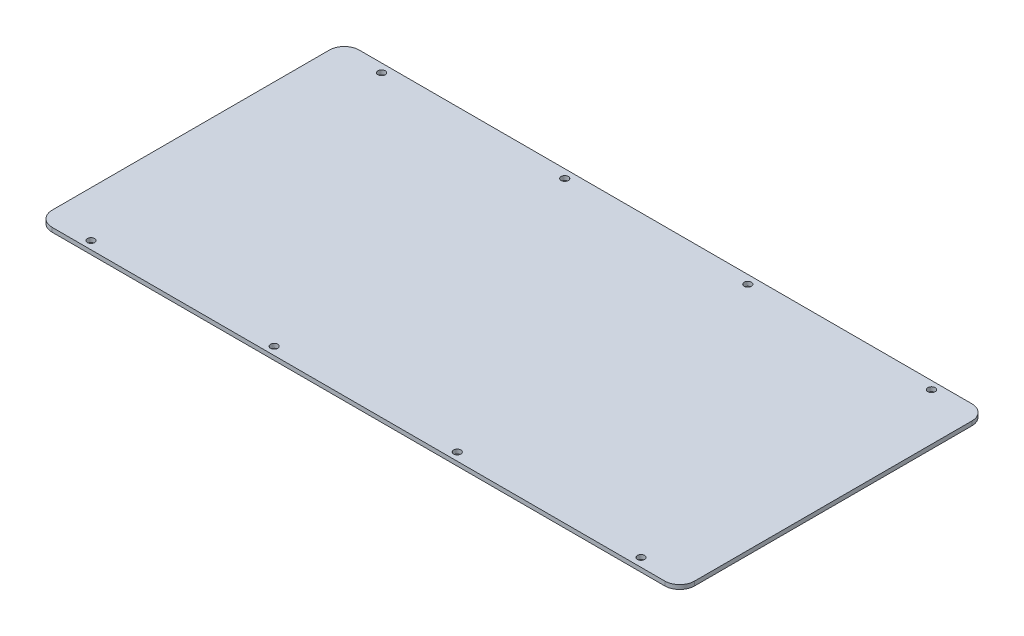
ISO-10303-21;
HEADER;
FILE_DESCRIPTION(('STEP AP214'),'2;1');
FILE_NAME('part.step','',(''),(''),'','','');
FILE_SCHEMA(('AUTOMOTIVE_DESIGN { 1 0 10303 214 1 1 1 1 }'));
ENDSEC;
DATA;
#1=APPLICATION_CONTEXT('core data for automotive mechanical design processes');
#2=APPLICATION_PROTOCOL_DEFINITION('international standard','automotive_design',2000,#1);
#3=PRODUCT_CONTEXT('',#1,'mechanical');
#4=PRODUCT('Part','Part','',(#3));
#5=PRODUCT_RELATED_PRODUCT_CATEGORY('part','',(#4));
#6=PRODUCT_DEFINITION_FORMATION('','',#4);
#7=PRODUCT_DEFINITION_CONTEXT('part definition',#1,'design');
#8=PRODUCT_DEFINITION('design','',#6,#7);
#9=PRODUCT_DEFINITION_SHAPE('','',#8);
#10=(LENGTH_UNIT() NAMED_UNIT(*) SI_UNIT(.MILLI.,.METRE.));
#11=(NAMED_UNIT(*) PLANE_ANGLE_UNIT() SI_UNIT($,.RADIAN.));
#12=(NAMED_UNIT(*) SI_UNIT($,.STERADIAN.) SOLID_ANGLE_UNIT());
#13=UNCERTAINTY_MEASURE_WITH_UNIT(LENGTH_MEASURE(1.E-05),#10,'distance_accuracy_value','');
#14=(GEOMETRIC_REPRESENTATION_CONTEXT(3) GLOBAL_UNCERTAINTY_ASSIGNED_CONTEXT((#13)) GLOBAL_UNIT_ASSIGNED_CONTEXT((#10,
#11,#12)) REPRESENTATION_CONTEXT('',''));
#15=CARTESIAN_POINT('',(0.,0.,0.));
#16=DIRECTION('',(0.,0.,1.));
#17=DIRECTION('',(1.,0.,0.));
#18=AXIS2_PLACEMENT_3D('',#15,#16,#17);
#19=CARTESIAN_POINT('',(0.,0.,0.));
#20=DIRECTION('',(0.,-1.,0.));
#21=DIRECTION('',(0.,0.,-1.));
#22=AXIS2_PLACEMENT_3D('',#19,#20,#21);
#23=PLANE('',#22);
#24=CARTESIAN_POINT('',(305.993493561658,0.,-207.19586570233));
#25=DIRECTION('',(0.,1.,0.));
#26=DIRECTION('',(0.,0.,1.));
#27=AXIS2_PLACEMENT_3D('',#24,#25,#26);
#28=CIRCLE('',#27,1.69999999999992);
#29=CARTESIAN_POINT('',(305.993493561658,0.,-205.49586570233));
#30=VERTEX_POINT('',#29);
#31=EDGE_CURVE('E197',#30,#30,#28,.T.);
#32=ORIENTED_EDGE('',*,*,#31,.T.);
#33=EDGE_LOOP('',(#32));
#34=FACE_BOUND('',#33,.T.);
#35=CARTESIAN_POINT('',(133.993493561658,0.,-70.4964057023296));
#36=DIRECTION('',(0.,1.,0.));
#37=DIRECTION('',(0.,0.,1.));
#38=AXIS2_PLACEMENT_3D('',#35,#36,#37);
#39=CIRCLE('',#38,1.70000000000001);
#40=CARTESIAN_POINT('',(133.993493561658,0.,-68.7964057023296));
#41=VERTEX_POINT('',#40);
#42=EDGE_CURVE('E190',#41,#41,#39,.T.);
#43=ORIENTED_EDGE('',*,*,#42,.T.);
#44=EDGE_LOOP('',(#43));
#45=FACE_BOUND('',#44,.T.);
#46=CARTESIAN_POINT('',(47.9934935616575,0.,-70.4964057023296));
#47=DIRECTION('',(0.,1.,0.));
#48=DIRECTION('',(0.,0.,1.));
#49=AXIS2_PLACEMENT_3D('',#46,#47,#48);
#50=CIRCLE('',#49,1.7);
#51=CARTESIAN_POINT('',(47.9934935616575,0.,-68.7964057023296));
#52=VERTEX_POINT('',#51);
#53=EDGE_CURVE('E208',#52,#52,#50,.T.);
#54=ORIENTED_EDGE('',*,*,#53,.T.);
#55=EDGE_LOOP('',(#54));
#56=FACE_BOUND('',#55,.T.);
#57=CARTESIAN_POINT('',(219.993493561658,0.,-70.4964057023296));
#58=DIRECTION('',(0.,1.,0.));
#59=DIRECTION('',(0.,0.,1.));
#60=AXIS2_PLACEMENT_3D('',#57,#58,#59);
#61=CIRCLE('',#60,1.70000000000001);
#62=CARTESIAN_POINT('',(219.993493561658,0.,-68.7964057023296));
#63=VERTEX_POINT('',#62);
#64=EDGE_CURVE('E202',#63,#63,#61,.T.);
#65=ORIENTED_EDGE('',*,*,#64,.T.);
#66=EDGE_LOOP('',(#65));
#67=FACE_BOUND('',#66,.T.);
#68=CARTESIAN_POINT('',(133.993493561658,0.,-206.94586570233));
#69=DIRECTION('',(0.,1.,0.));
#70=DIRECTION('',(0.,0.,1.));
#71=AXIS2_PLACEMENT_3D('',#68,#69,#70);
#72=CIRCLE('',#71,1.70000000000001);
#73=CARTESIAN_POINT('',(133.993493561658,0.,-205.24586570233));
#74=VERTEX_POINT('',#73);
#75=EDGE_CURVE('E172',#74,#74,#72,.T.);
#76=ORIENTED_EDGE('',*,*,#75,.T.);
#77=EDGE_LOOP('',(#76));
#78=FACE_BOUND('',#77,.T.);
#79=CARTESIAN_POINT('',(305.993493561658,0.,-70.7464057023296));
#80=DIRECTION('',(0.,1.,0.));
#81=DIRECTION('',(0.,0.,1.));
#82=AXIS2_PLACEMENT_3D('',#79,#80,#81);
#83=CIRCLE('',#82,1.69999999999992);
#84=CARTESIAN_POINT('',(305.993493561658,0.,-69.0464057023297));
#85=VERTEX_POINT('',#84);
#86=EDGE_CURVE('E12',#85,#85,#83,.T.);
#87=ORIENTED_EDGE('',*,*,#86,.T.);
#88=EDGE_LOOP('',(#87));
#89=FACE_BOUND('',#88,.T.);
#90=CARTESIAN_POINT('',(219.993493561658,0.,-206.94586570233));
#91=DIRECTION('',(0.,1.,0.));
#92=DIRECTION('',(0.,0.,1.));
#93=AXIS2_PLACEMENT_3D('',#90,#91,#92);
#94=CIRCLE('',#93,1.70000000000001);
#95=CARTESIAN_POINT('',(219.993493561658,0.,-205.24586570233));
#96=VERTEX_POINT('',#95);
#97=EDGE_CURVE('E178',#96,#96,#94,.T.);
#98=ORIENTED_EDGE('',*,*,#97,.T.);
#99=EDGE_LOOP('',(#98));
#100=FACE_BOUND('',#99,.T.);
#101=CARTESIAN_POINT('',(47.9934935616575,0.,-206.94586570233));
#102=DIRECTION('',(0.,1.,0.));
#103=DIRECTION('',(0.,0.,1.));
#104=AXIS2_PLACEMENT_3D('',#101,#102,#103);
#105=CIRCLE('',#104,1.7);
#106=CARTESIAN_POINT('',(47.9934935616575,0.,-205.24586570233));
#107=VERTEX_POINT('',#106);
#108=EDGE_CURVE('E185',#107,#107,#105,.T.);
#109=ORIENTED_EDGE('',*,*,#108,.T.);
#110=EDGE_LOOP('',(#109));
#111=FACE_BOUND('',#110,.T.);
#112=DIRECTION('',(0.,0.,1.));
#113=VECTOR('',#112,1.);
#114=CARTESIAN_POINT('',(26.4934935616575,0.,-73.7464057023296));
#115=LINE('',#114,#113);
#116=CARTESIAN_POINT('',(26.4934935616575,0.,-203.94586570233));
#117=VERTEX_POINT('',#116);
#118=CARTESIAN_POINT('',(26.4934935616575,0.,-73.7464057023296));
#119=VERTEX_POINT('',#118);
#120=EDGE_CURVE('E121',#117,#119,#115,.T.);
#121=ORIENTED_EDGE('',*,*,#120,.F.);
#122=CARTESIAN_POINT('',(33.4934935616575,0.,-203.94586570233));
#123=DIRECTION('',(0.,1.,0.));
#124=DIRECTION('',(0.,0.,1.));
#125=AXIS2_PLACEMENT_3D('',#122,#123,#124);
#126=CIRCLE('',#125,7.);
#127=CARTESIAN_POINT('',(33.4934935616575,0.,-210.94586570233));
#128=VERTEX_POINT('',#127);
#129=EDGE_CURVE('E62',#128,#117,#126,.T.);
#130=ORIENTED_EDGE('',*,*,#129,.F.);
#131=DIRECTION('',(-1.,0.,0.));
#132=VECTOR('',#131,1.);
#133=CARTESIAN_POINT('',(33.4934935616575,0.,-210.94586570233));
#134=LINE('',#133,#132);
#135=CARTESIAN_POINT('',(321.192843561658,0.,-210.94586570233));
#136=VERTEX_POINT('',#135);
#137=EDGE_CURVE('E136',#136,#128,#134,.T.);
#138=ORIENTED_EDGE('',*,*,#137,.F.);
#139=CARTESIAN_POINT('',(321.192843561658,0.,-203.94586570233));
#140=DIRECTION('',(0.,1.,0.));
#141=DIRECTION('',(0.,0.,1.));
#142=AXIS2_PLACEMENT_3D('',#139,#140,#141);
#143=CIRCLE('',#142,7.00000000000001);
#144=CARTESIAN_POINT('',(328.192843561658,0.,-203.94586570233));
#145=VERTEX_POINT('',#144);
#146=EDGE_CURVE('E133',#145,#136,#143,.T.);
#147=ORIENTED_EDGE('',*,*,#146,.F.);
#148=DIRECTION('',(0.,0.,-1.));
#149=VECTOR('',#148,1.);
#150=CARTESIAN_POINT('',(328.192843561658,0.,-203.94586570233));
#151=LINE('',#150,#149);
#152=CARTESIAN_POINT('',(328.192843561658,0.,-73.7464057023296));
#153=VERTEX_POINT('',#152);
#154=EDGE_CURVE('E127',#153,#145,#151,.T.);
#155=ORIENTED_EDGE('',*,*,#154,.F.);
#156=CARTESIAN_POINT('',(321.192843561658,0.,-73.7464057023296));
#157=DIRECTION('',(0.,1.,0.));
#158=DIRECTION('',(0.,0.,1.));
#159=AXIS2_PLACEMENT_3D('',#156,#157,#158);
#160=CIRCLE('',#159,7.);
#161=CARTESIAN_POINT('',(321.192843561658,0.,-66.7464057023296));
#162=VERTEX_POINT('',#161);
#163=EDGE_CURVE('E125',#162,#153,#160,.T.);
#164=ORIENTED_EDGE('',*,*,#163,.F.);
#165=DIRECTION('',(1.,0.,0.));
#166=VECTOR('',#165,1.);
#167=CARTESIAN_POINT('',(321.192843561658,0.,-66.7464057023296));
#168=LINE('',#167,#166);
#169=CARTESIAN_POINT('',(33.4934935616576,0.,-66.7464057023296));
#170=VERTEX_POINT('',#169);
#171=EDGE_CURVE('E108',#170,#162,#168,.T.);
#172=ORIENTED_EDGE('',*,*,#171,.F.);
#173=CARTESIAN_POINT('',(33.4934935616575,0.,-73.7464057023296));
#174=DIRECTION('',(0.,1.,0.));
#175=DIRECTION('',(0.,0.,1.));
#176=AXIS2_PLACEMENT_3D('',#173,#174,#175);
#177=CIRCLE('',#176,7.);
#178=EDGE_CURVE('E116',#119,#170,#177,.T.);
#179=ORIENTED_EDGE('',*,*,#178,.F.);
#180=EDGE_LOOP('',(#121,#130,#138,#147,#155,#164,#172,#179));
#181=FACE_BOUND('',#180,.T.);
#182=ADVANCED_FACE('F40',(#34,#45,#56,#67,#78,#89,#100,#111,#181),#23,.T.);
#183=CARTESIAN_POINT('',(305.993493561658,0.,-70.7464057023296));
#184=DIRECTION('',(0.,1.,0.));
#185=DIRECTION('',(0.,0.,1.));
#186=AXIS2_PLACEMENT_3D('',#183,#184,#185);
#187=CYLINDRICAL_SURFACE('',#186,1.69999999999992);
#188=ORIENTED_EDGE('',*,*,#86,.F.);
#189=EDGE_LOOP('',(#188));
#190=FACE_BOUND('',#189,.T.);
#191=CARTESIAN_POINT('',(305.993493561658,2.,-70.7464057023296));
#192=DIRECTION('',(0.,1.,0.));
#193=DIRECTION('',(0.,0.,1.));
#194=AXIS2_PLACEMENT_3D('',#191,#192,#193);
#195=CIRCLE('',#194,1.69999999999992);
#196=CARTESIAN_POINT('',(305.993493561658,2.,-69.0464057023297));
#197=VERTEX_POINT('',#196);
#198=EDGE_CURVE('E43',#197,#197,#195,.T.);
#199=ORIENTED_EDGE('',*,*,#198,.T.);
#200=EDGE_LOOP('',(#199));
#201=FACE_BOUND('',#200,.T.);
#202=ADVANCED_FACE('F261',(#190,#201),#187,.F.);
#203=CARTESIAN_POINT('',(219.993493561658,0.,-206.94586570233));
#204=DIRECTION('',(0.,1.,0.));
#205=DIRECTION('',(0.,0.,1.));
#206=AXIS2_PLACEMENT_3D('',#203,#204,#205);
#207=CYLINDRICAL_SURFACE('',#206,1.70000000000001);
#208=ORIENTED_EDGE('',*,*,#97,.F.);
#209=EDGE_LOOP('',(#208));
#210=FACE_BOUND('',#209,.T.);
#211=CARTESIAN_POINT('',(219.993493561658,2.,-206.94586570233));
#212=DIRECTION('',(0.,1.,0.));
#213=DIRECTION('',(0.,0.,1.));
#214=AXIS2_PLACEMENT_3D('',#211,#212,#213);
#215=CIRCLE('',#214,1.70000000000001);
#216=CARTESIAN_POINT('',(219.993493561658,2.,-205.24586570233));
#217=VERTEX_POINT('',#216);
#218=EDGE_CURVE('E182',#217,#217,#215,.T.);
#219=ORIENTED_EDGE('',*,*,#218,.T.);
#220=EDGE_LOOP('',(#219));
#221=FACE_BOUND('',#220,.T.);
#222=ADVANCED_FACE('F266',(#210,#221),#207,.F.);
#223=CARTESIAN_POINT('',(47.9934935616575,0.,-206.94586570233));
#224=DIRECTION('',(0.,1.,0.));
#225=DIRECTION('',(0.,0.,1.));
#226=AXIS2_PLACEMENT_3D('',#223,#224,#225);
#227=CYLINDRICAL_SURFACE('',#226,1.7);
#228=ORIENTED_EDGE('',*,*,#108,.F.);
#229=EDGE_LOOP('',(#228));
#230=FACE_BOUND('',#229,.T.);
#231=CARTESIAN_POINT('',(47.9934935616575,2.,-206.94586570233));
#232=DIRECTION('',(0.,1.,0.));
#233=DIRECTION('',(0.,0.,1.));
#234=AXIS2_PLACEMENT_3D('',#231,#232,#233);
#235=CIRCLE('',#234,1.7);
#236=CARTESIAN_POINT('',(47.9934935616575,2.,-205.24586570233));
#237=VERTEX_POINT('',#236);
#238=EDGE_CURVE('E175',#237,#237,#235,.T.);
#239=ORIENTED_EDGE('',*,*,#238,.T.);
#240=EDGE_LOOP('',(#239));
#241=FACE_BOUND('',#240,.T.);
#242=ADVANCED_FACE('F285',(#230,#241),#227,.F.);
#243=CARTESIAN_POINT('',(33.4934935616575,0.,-203.94586570233));
#244=DIRECTION('',(0.,1.,0.));
#245=DIRECTION('',(0.,0.,1.));
#246=AXIS2_PLACEMENT_3D('',#243,#244,#245);
#247=CYLINDRICAL_SURFACE('',#246,7.);
#248=CARTESIAN_POINT('',(33.4934935616575,2.,-203.94586570233));
#249=DIRECTION('',(0.,1.,0.));
#250=DIRECTION('',(0.,0.,1.));
#251=AXIS2_PLACEMENT_3D('',#248,#249,#250);
#252=CIRCLE('',#251,7.);
#253=CARTESIAN_POINT('',(33.4934935616575,2.,-210.94586570233));
#254=VERTEX_POINT('',#253);
#255=CARTESIAN_POINT('',(26.4934935616575,2.,-203.94586570233));
#256=VERTEX_POINT('',#255);
#257=EDGE_CURVE('E140',#254,#256,#252,.T.);
#258=ORIENTED_EDGE('',*,*,#257,.F.);
#259=DIRECTION('',(0.,1.,0.));
#260=VECTOR('',#259,1.);
#261=CARTESIAN_POINT('',(33.4934935616575,0.,-210.94586570233));
#262=LINE('',#261,#260);
#263=EDGE_CURVE('E160',#128,#254,#262,.T.);
#264=ORIENTED_EDGE('',*,*,#263,.F.);
#265=ORIENTED_EDGE('',*,*,#129,.T.);
#266=DIRECTION('',(0.,1.,0.));
#267=VECTOR('',#266,1.);
#268=CARTESIAN_POINT('',(26.4934935616575,0.,-203.94586570233));
#269=LINE('',#268,#267);
#270=EDGE_CURVE('E139',#117,#256,#269,.T.);
#271=ORIENTED_EDGE('',*,*,#270,.T.);
#272=EDGE_LOOP('',(#258,#264,#265,#271));
#273=FACE_BOUND('',#272,.T.);
#274=ADVANCED_FACE('F235',(#273),#247,.T.);
#275=CARTESIAN_POINT('',(33.4934935616575,0.,-210.94586570233));
#276=DIRECTION('',(0.,0.,-1.));
#277=DIRECTION('',(-1.,0.,0.));
#278=AXIS2_PLACEMENT_3D('',#275,#276,#277);
#279=PLANE('',#278);
#280=DIRECTION('',(-1.,0.,0.));
#281=VECTOR('',#280,1.);
#282=CARTESIAN_POINT('',(33.4934935616575,2.,-210.94586570233));
#283=LINE('',#282,#281);
#284=CARTESIAN_POINT('',(321.192843561658,2.,-210.94586570233));
#285=VERTEX_POINT('',#284);
#286=EDGE_CURVE('E157',#285,#254,#283,.T.);
#287=ORIENTED_EDGE('',*,*,#286,.F.);
#288=DIRECTION('',(0.,1.,0.));
#289=VECTOR('',#288,1.);
#290=CARTESIAN_POINT('',(321.192843561658,0.,-210.94586570233));
#291=LINE('',#290,#289);
#292=EDGE_CURVE('E163',#136,#285,#291,.T.);
#293=ORIENTED_EDGE('',*,*,#292,.F.);
#294=ORIENTED_EDGE('',*,*,#137,.T.);
#295=ORIENTED_EDGE('',*,*,#263,.T.);
#296=EDGE_LOOP('',(#287,#293,#294,#295));
#297=FACE_BOUND('',#296,.T.);
#298=ADVANCED_FACE('F242',(#297),#279,.T.);
#299=CARTESIAN_POINT('',(321.192843561658,0.,-203.94586570233));
#300=DIRECTION('',(0.,1.,0.));
#301=DIRECTION('',(0.,0.,1.));
#302=AXIS2_PLACEMENT_3D('',#299,#300,#301);
#303=CYLINDRICAL_SURFACE('',#302,7.00000000000001);
#304=CARTESIAN_POINT('',(321.192843561658,2.,-203.94586570233));
#305=DIRECTION('',(0.,1.,0.));
#306=DIRECTION('',(0.,0.,1.));
#307=AXIS2_PLACEMENT_3D('',#304,#305,#306);
#308=CIRCLE('',#307,7.00000000000001);
#309=CARTESIAN_POINT('',(328.192843561658,2.,-203.94586570233));
#310=VERTEX_POINT('',#309);
#311=EDGE_CURVE('E154',#310,#285,#308,.T.);
#312=ORIENTED_EDGE('',*,*,#311,.F.);
#313=DIRECTION('',(0.,1.,0.));
#314=VECTOR('',#313,1.);
#315=CARTESIAN_POINT('',(328.192843561658,0.,-203.94586570233));
#316=LINE('',#315,#314);
#317=EDGE_CURVE('E165',#145,#310,#316,.T.);
#318=ORIENTED_EDGE('',*,*,#317,.F.);
#319=ORIENTED_EDGE('',*,*,#146,.T.);
#320=ORIENTED_EDGE('',*,*,#292,.T.);
#321=EDGE_LOOP('',(#312,#318,#319,#320));
#322=FACE_BOUND('',#321,.T.);
#323=ADVANCED_FACE('F245',(#322),#303,.T.);
#324=CARTESIAN_POINT('',(328.192843561658,0.,-203.94586570233));
#325=DIRECTION('',(1.,0.,0.));
#326=DIRECTION('',(0.,0.,-1.));
#327=AXIS2_PLACEMENT_3D('',#324,#325,#326);
#328=PLANE('',#327);
#329=DIRECTION('',(0.,0.,-1.));
#330=VECTOR('',#329,1.);
#331=CARTESIAN_POINT('',(328.192843561658,2.,-203.94586570233));
#332=LINE('',#331,#330);
#333=CARTESIAN_POINT('',(328.192843561658,2.,-73.7464057023296));
#334=VERTEX_POINT('',#333);
#335=EDGE_CURVE('E151',#334,#310,#332,.T.);
#336=ORIENTED_EDGE('',*,*,#335,.F.);
#337=DIRECTION('',(0.,1.,0.));
#338=VECTOR('',#337,1.);
#339=CARTESIAN_POINT('',(328.192843561658,0.,-73.7464057023296));
#340=LINE('',#339,#338);
#341=EDGE_CURVE('E167',#153,#334,#340,.T.);
#342=ORIENTED_EDGE('',*,*,#341,.F.);
#343=ORIENTED_EDGE('',*,*,#154,.T.);
#344=ORIENTED_EDGE('',*,*,#317,.T.);
#345=EDGE_LOOP('',(#336,#342,#343,#344));
#346=FACE_BOUND('',#345,.T.);
#347=ADVANCED_FACE('F248',(#346),#328,.T.);
#348=CARTESIAN_POINT('',(321.192843561658,0.,-73.7464057023296));
#349=DIRECTION('',(0.,1.,0.));
#350=DIRECTION('',(0.,0.,1.));
#351=AXIS2_PLACEMENT_3D('',#348,#349,#350);
#352=CYLINDRICAL_SURFACE('',#351,7.);
#353=CARTESIAN_POINT('',(321.192843561658,2.,-73.7464057023296));
#354=DIRECTION('',(0.,1.,0.));
#355=DIRECTION('',(0.,0.,1.));
#356=AXIS2_PLACEMENT_3D('',#353,#354,#355);
#357=CIRCLE('',#356,7.);
#358=CARTESIAN_POINT('',(321.192843561658,2.,-66.7464057023296));
#359=VERTEX_POINT('',#358);
#360=EDGE_CURVE('E148',#359,#334,#357,.T.);
#361=ORIENTED_EDGE('',*,*,#360,.F.);
#362=DIRECTION('',(0.,1.,0.));
#363=VECTOR('',#362,1.);
#364=CARTESIAN_POINT('',(321.192843561658,0.,-66.7464057023296));
#365=LINE('',#364,#363);
#366=EDGE_CURVE('E112',#162,#359,#365,.T.);
#367=ORIENTED_EDGE('',*,*,#366,.F.);
#368=ORIENTED_EDGE('',*,*,#163,.T.);
#369=ORIENTED_EDGE('',*,*,#341,.T.);
#370=EDGE_LOOP('',(#361,#367,#368,#369));
#371=FACE_BOUND('',#370,.T.);
#372=ADVANCED_FACE('F251',(#371),#352,.T.);
#373=CARTESIAN_POINT('',(321.192843561658,0.,-66.7464057023296));
#374=DIRECTION('',(0.,0.,1.));
#375=DIRECTION('',(1.,0.,0.));
#376=AXIS2_PLACEMENT_3D('',#373,#374,#375);
#377=PLANE('',#376);
#378=DIRECTION('',(1.,0.,0.));
#379=VECTOR('',#378,1.);
#380=CARTESIAN_POINT('',(321.192843561658,2.,-66.7464057023296));
#381=LINE('',#380,#379);
#382=CARTESIAN_POINT('',(33.4934935616576,2.,-66.7464057023296));
#383=VERTEX_POINT('',#382);
#384=EDGE_CURVE('E111',#383,#359,#381,.T.);
#385=ORIENTED_EDGE('',*,*,#384,.F.);
#386=DIRECTION('',(0.,1.,0.));
#387=VECTOR('',#386,1.);
#388=CARTESIAN_POINT('',(33.4934935616576,0.,-66.7464057023296));
#389=LINE('',#388,#387);
#390=EDGE_CURVE('E104',#170,#383,#389,.T.);
#391=ORIENTED_EDGE('',*,*,#390,.F.);
#392=ORIENTED_EDGE('',*,*,#171,.T.);
#393=ORIENTED_EDGE('',*,*,#366,.T.);
#394=EDGE_LOOP('',(#385,#391,#392,#393));
#395=FACE_BOUND('',#394,.T.);
#396=ADVANCED_FACE('F106',(#395),#377,.T.);
#397=CARTESIAN_POINT('',(33.4934935616575,0.,-73.7464057023296));
#398=DIRECTION('',(0.,1.,0.));
#399=DIRECTION('',(0.,0.,1.));
#400=AXIS2_PLACEMENT_3D('',#397,#398,#399);
#401=CYLINDRICAL_SURFACE('',#400,7.);
#402=CARTESIAN_POINT('',(33.4934935616575,2.,-73.7464057023296));
#403=DIRECTION('',(0.,1.,0.));
#404=DIRECTION('',(0.,0.,1.));
#405=AXIS2_PLACEMENT_3D('',#402,#403,#404);
#406=CIRCLE('',#405,7.);
#407=CARTESIAN_POINT('',(26.4934935616575,2.,-73.7464057023296));
#408=VERTEX_POINT('',#407);
#409=EDGE_CURVE('E54',#408,#383,#406,.T.);
#410=ORIENTED_EDGE('',*,*,#409,.F.);
#411=DIRECTION('',(0.,1.,0.));
#412=VECTOR('',#411,1.);
#413=CARTESIAN_POINT('',(26.4934935616575,0.,-73.7464057023296));
#414=LINE('',#413,#412);
#415=EDGE_CURVE('E113',#119,#408,#414,.T.);
#416=ORIENTED_EDGE('',*,*,#415,.F.);
#417=ORIENTED_EDGE('',*,*,#178,.T.);
#418=ORIENTED_EDGE('',*,*,#390,.T.);
#419=EDGE_LOOP('',(#410,#416,#417,#418));
#420=FACE_BOUND('',#419,.T.);
#421=ADVANCED_FACE('F117',(#420),#401,.T.);
#422=CARTESIAN_POINT('',(26.4934935616575,0.,-73.7464057023296));
#423=DIRECTION('',(-1.,0.,0.));
#424=DIRECTION('',(0.,0.,1.));
#425=AXIS2_PLACEMENT_3D('',#422,#423,#424);
#426=PLANE('',#425);
#427=DIRECTION('',(0.,0.,1.));
#428=VECTOR('',#427,1.);
#429=CARTESIAN_POINT('',(26.4934935616575,2.,-73.7464057023296));
#430=LINE('',#429,#428);
#431=EDGE_CURVE('E143',#256,#408,#430,.T.);
#432=ORIENTED_EDGE('',*,*,#431,.F.);
#433=ORIENTED_EDGE('',*,*,#270,.F.);
#434=ORIENTED_EDGE('',*,*,#120,.T.);
#435=ORIENTED_EDGE('',*,*,#415,.T.);
#436=EDGE_LOOP('',(#432,#433,#434,#435));
#437=FACE_BOUND('',#436,.T.);
#438=ADVANCED_FACE('F237',(#437),#426,.T.);
#439=CARTESIAN_POINT('',(133.993493561658,0.,-206.94586570233));
#440=DIRECTION('',(0.,1.,0.));
#441=DIRECTION('',(0.,0.,1.));
#442=AXIS2_PLACEMENT_3D('',#439,#440,#441);
#443=CYLINDRICAL_SURFACE('',#442,1.70000000000001);
#444=ORIENTED_EDGE('',*,*,#75,.F.);
#445=EDGE_LOOP('',(#444));
#446=FACE_BOUND('',#445,.T.);
#447=CARTESIAN_POINT('',(133.993493561658,2.,-206.94586570233));
#448=DIRECTION('',(0.,1.,0.));
#449=DIRECTION('',(0.,0.,1.));
#450=AXIS2_PLACEMENT_3D('',#447,#448,#449);
#451=CIRCLE('',#450,1.70000000000001);
#452=CARTESIAN_POINT('',(133.993493561658,2.,-205.24586570233));
#453=VERTEX_POINT('',#452);
#454=EDGE_CURVE('E162',#453,#453,#451,.T.);
#455=ORIENTED_EDGE('',*,*,#454,.T.);
#456=EDGE_LOOP('',(#455));
#457=FACE_BOUND('',#456,.T.);
#458=ADVANCED_FACE('F308',(#446,#457),#443,.F.);
#459=CARTESIAN_POINT('',(219.993493561658,0.,-70.4964057023296));
#460=DIRECTION('',(0.,1.,0.));
#461=DIRECTION('',(0.,0.,1.));
#462=AXIS2_PLACEMENT_3D('',#459,#460,#461);
#463=CYLINDRICAL_SURFACE('',#462,1.70000000000001);
#464=ORIENTED_EDGE('',*,*,#64,.F.);
#465=EDGE_LOOP('',(#464));
#466=FACE_BOUND('',#465,.T.);
#467=CARTESIAN_POINT('',(219.993493561658,2.,-70.4964057023296));
#468=DIRECTION('',(0.,1.,0.));
#469=DIRECTION('',(0.,0.,1.));
#470=AXIS2_PLACEMENT_3D('',#467,#468,#469);
#471=CIRCLE('',#470,1.70000000000001);
#472=CARTESIAN_POINT('',(219.993493561658,2.,-68.7964057023296));
#473=VERTEX_POINT('',#472);
#474=EDGE_CURVE('E205',#473,#473,#471,.T.);
#475=ORIENTED_EDGE('',*,*,#474,.T.);
#476=EDGE_LOOP('',(#475));
#477=FACE_BOUND('',#476,.T.);
#478=ADVANCED_FACE('F305',(#466,#477),#463,.F.);
#479=CARTESIAN_POINT('',(47.9934935616575,0.,-70.4964057023296));
#480=DIRECTION('',(0.,1.,0.));
#481=DIRECTION('',(0.,0.,1.));
#482=AXIS2_PLACEMENT_3D('',#479,#480,#481);
#483=CYLINDRICAL_SURFACE('',#482,1.7);
#484=ORIENTED_EDGE('',*,*,#53,.F.);
#485=EDGE_LOOP('',(#484));
#486=FACE_BOUND('',#485,.T.);
#487=CARTESIAN_POINT('',(47.9934935616575,2.,-70.4964057023296));
#488=DIRECTION('',(0.,1.,0.));
#489=DIRECTION('',(0.,0.,1.));
#490=AXIS2_PLACEMENT_3D('',#487,#488,#489);
#491=CIRCLE('',#490,1.7);
#492=CARTESIAN_POINT('',(47.9934935616575,2.,-68.7964057023296));
#493=VERTEX_POINT('',#492);
#494=EDGE_CURVE('E193',#493,#493,#491,.T.);
#495=ORIENTED_EDGE('',*,*,#494,.T.);
#496=EDGE_LOOP('',(#495));
#497=FACE_BOUND('',#496,.T.);
#498=ADVANCED_FACE('F214',(#486,#497),#483,.F.);
#499=CARTESIAN_POINT('',(133.993493561658,0.,-70.4964057023296));
#500=DIRECTION('',(0.,1.,0.));
#501=DIRECTION('',(0.,0.,1.));
#502=AXIS2_PLACEMENT_3D('',#499,#500,#501);
#503=CYLINDRICAL_SURFACE('',#502,1.70000000000001);
#504=ORIENTED_EDGE('',*,*,#42,.F.);
#505=EDGE_LOOP('',(#504));
#506=FACE_BOUND('',#505,.T.);
#507=CARTESIAN_POINT('',(133.993493561658,2.,-70.4964057023296));
#508=DIRECTION('',(0.,1.,0.));
#509=DIRECTION('',(0.,0.,1.));
#510=AXIS2_PLACEMENT_3D('',#507,#508,#509);
#511=CIRCLE('',#510,1.70000000000001);
#512=CARTESIAN_POINT('',(133.993493561658,2.,-68.7964057023296));
#513=VERTEX_POINT('',#512);
#514=EDGE_CURVE('E194',#513,#513,#511,.T.);
#515=ORIENTED_EDGE('',*,*,#514,.T.);
#516=EDGE_LOOP('',(#515));
#517=FACE_BOUND('',#516,.T.);
#518=ADVANCED_FACE('F298',(#506,#517),#503,.F.);
#519=CARTESIAN_POINT('',(305.993493561658,0.,-207.19586570233));
#520=DIRECTION('',(0.,1.,0.));
#521=DIRECTION('',(0.,0.,1.));
#522=AXIS2_PLACEMENT_3D('',#519,#520,#521);
#523=CYLINDRICAL_SURFACE('',#522,1.69999999999992);
#524=ORIENTED_EDGE('',*,*,#31,.F.);
#525=EDGE_LOOP('',(#524));
#526=FACE_BOUND('',#525,.T.);
#527=CARTESIAN_POINT('',(305.993493561658,2.,-207.19586570233));
#528=DIRECTION('',(0.,1.,0.));
#529=DIRECTION('',(0.,0.,1.));
#530=AXIS2_PLACEMENT_3D('',#527,#528,#529);
#531=CIRCLE('',#530,1.69999999999992);
#532=CARTESIAN_POINT('',(305.993493561658,2.,-205.49586570233));
#533=VERTEX_POINT('',#532);
#534=EDGE_CURVE('E181',#533,#533,#531,.T.);
#535=ORIENTED_EDGE('',*,*,#534,.T.);
#536=EDGE_LOOP('',(#535));
#537=FACE_BOUND('',#536,.T.);
#538=ADVANCED_FACE('F219',(#526,#537),#523,.F.);
#539=CARTESIAN_POINT('',(0.,2.,0.));
#540=DIRECTION('',(0.,-1.,0.));
#541=DIRECTION('',(0.,0.,-1.));
#542=AXIS2_PLACEMENT_3D('',#539,#540,#541);
#543=PLANE('',#542);
#544=ORIENTED_EDGE('',*,*,#534,.F.);
#545=EDGE_LOOP('',(#544));
#546=FACE_BOUND('',#545,.T.);
#547=ORIENTED_EDGE('',*,*,#514,.F.);
#548=EDGE_LOOP('',(#547));
#549=FACE_BOUND('',#548,.T.);
#550=ORIENTED_EDGE('',*,*,#494,.F.);
#551=EDGE_LOOP('',(#550));
#552=FACE_BOUND('',#551,.T.);
#553=ORIENTED_EDGE('',*,*,#474,.F.);
#554=EDGE_LOOP('',(#553));
#555=FACE_BOUND('',#554,.T.);
#556=ORIENTED_EDGE('',*,*,#454,.F.);
#557=EDGE_LOOP('',(#556));
#558=FACE_BOUND('',#557,.T.);
#559=ORIENTED_EDGE('',*,*,#198,.F.);
#560=EDGE_LOOP('',(#559));
#561=FACE_BOUND('',#560,.T.);
#562=ORIENTED_EDGE('',*,*,#218,.F.);
#563=EDGE_LOOP('',(#562));
#564=FACE_BOUND('',#563,.T.);
#565=ORIENTED_EDGE('',*,*,#238,.F.);
#566=EDGE_LOOP('',(#565));
#567=FACE_BOUND('',#566,.T.);
#568=ORIENTED_EDGE('',*,*,#257,.T.);
#569=ORIENTED_EDGE('',*,*,#431,.T.);
#570=ORIENTED_EDGE('',*,*,#409,.T.);
#571=ORIENTED_EDGE('',*,*,#384,.T.);
#572=ORIENTED_EDGE('',*,*,#360,.T.);
#573=ORIENTED_EDGE('',*,*,#335,.T.);
#574=ORIENTED_EDGE('',*,*,#311,.T.);
#575=ORIENTED_EDGE('',*,*,#286,.T.);
#576=EDGE_LOOP('',(#568,#569,#570,#571,#572,#573,#574,#575));
#577=FACE_BOUND('',#576,.T.);
#578=ADVANCED_FACE('F216',(#546,#549,#552,#555,#558,#561,#564,#567,#577),#543,.F.);
#579=CLOSED_SHELL('',(#182,#202,#222,#242,#274,#298,#323,#347,#372,#396,#421,#438,#458,#478,
#498,#518,#538,#578));
#580=MANIFOLD_SOLID_BREP('B2',#579);
#581=ADVANCED_BREP_SHAPE_REPRESENTATION('',(#18,#580),#14);
#582=SHAPE_DEFINITION_REPRESENTATION(#9,#581);
ENDSEC;
END-ISO-10303-21;
